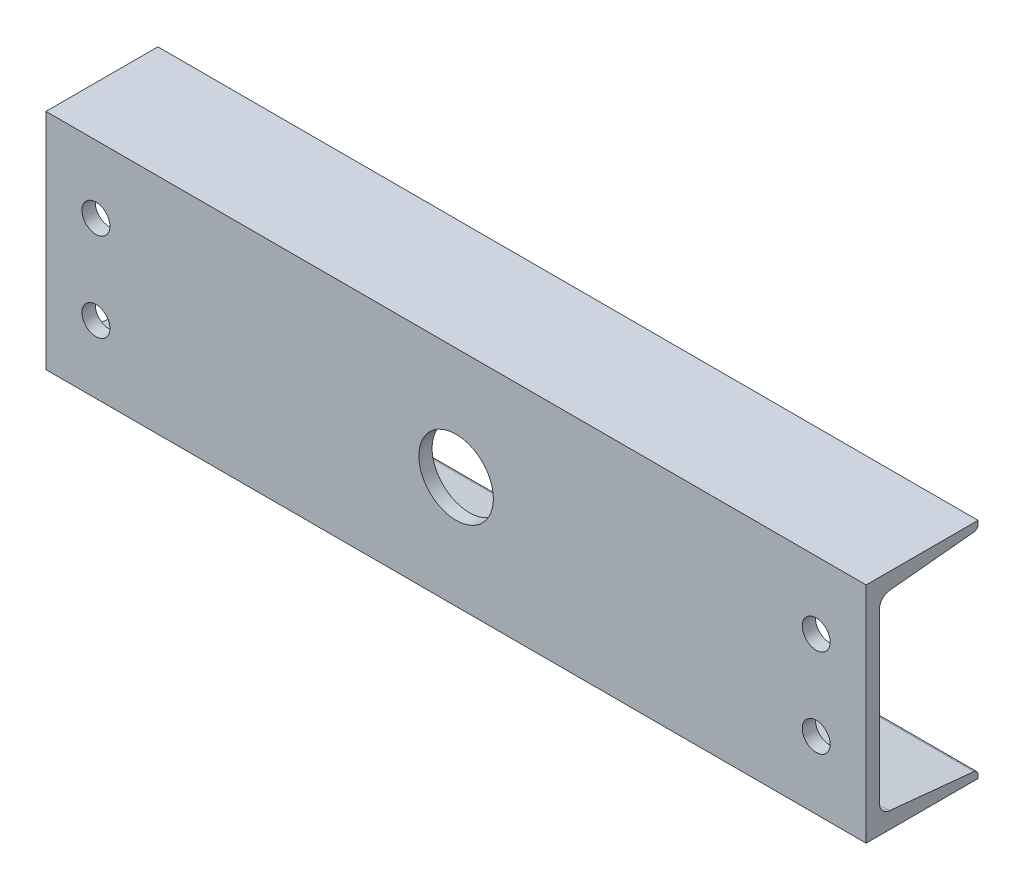
ISO-10303-21;
HEADER;
FILE_DESCRIPTION(('STEP AP214'),'2;1');
FILE_NAME('part.step','',(''),(''),'','','');
FILE_SCHEMA(('AUTOMOTIVE_DESIGN { 1 0 10303 214 1 1 1 1 }'));
ENDSEC;
DATA;
#1=APPLICATION_CONTEXT('core data for automotive mechanical design processes');
#2=APPLICATION_PROTOCOL_DEFINITION('international standard','automotive_design',2000,#1);
#3=PRODUCT_CONTEXT('',#1,'mechanical');
#4=PRODUCT('Part','Part','',(#3));
#5=PRODUCT_RELATED_PRODUCT_CATEGORY('part','',(#4));
#6=PRODUCT_DEFINITION_FORMATION('','',#4);
#7=PRODUCT_DEFINITION_CONTEXT('part definition',#1,'design');
#8=PRODUCT_DEFINITION('design','',#6,#7);
#9=PRODUCT_DEFINITION_SHAPE('','',#8);
#10=(LENGTH_UNIT() NAMED_UNIT(*) SI_UNIT(.MILLI.,.METRE.));
#11=(NAMED_UNIT(*) PLANE_ANGLE_UNIT() SI_UNIT($,.RADIAN.));
#12=(NAMED_UNIT(*) SI_UNIT($,.STERADIAN.) SOLID_ANGLE_UNIT());
#13=UNCERTAINTY_MEASURE_WITH_UNIT(LENGTH_MEASURE(1.E-05),#10,'distance_accuracy_value','');
#14=(GEOMETRIC_REPRESENTATION_CONTEXT(3) GLOBAL_UNCERTAINTY_ASSIGNED_CONTEXT((#13)) GLOBAL_UNIT_ASSIGNED_CONTEXT((#10,
#11,#12)) REPRESENTATION_CONTEXT('',''));
#15=CARTESIAN_POINT('',(0.,0.,0.));
#16=DIRECTION('',(0.,0.,1.));
#17=DIRECTION('',(1.,0.,0.));
#18=AXIS2_PLACEMENT_3D('',#15,#16,#17);
#19=CARTESIAN_POINT('',(279.4,-76.2,48.8061));
#20=DIRECTION('',(0.,1.,0.));
#21=DIRECTION('',(0.,0.,1.));
#22=AXIS2_PLACEMENT_3D('',#19,#20,#21);
#23=PLANE('',#22);
#24=DIRECTION('',(0.,0.,-1.));
#25=VECTOR('',#24,1.);
#26=CARTESIAN_POINT('',(-279.4,-76.2,48.8061));
#27=LINE('',#26,#25);
#28=CARTESIAN_POINT('',(-279.4,-76.2,48.8061));
#29=VERTEX_POINT('',#28);
#30=CARTESIAN_POINT('',(-279.4,-76.2,-27.3939));
#31=VERTEX_POINT('',#30);
#32=EDGE_CURVE('E157',#29,#31,#27,.T.);
#33=ORIENTED_EDGE('',*,*,#32,.T.);
#34=DIRECTION('',(-1.,0.,0.));
#35=VECTOR('',#34,1.);
#36=CARTESIAN_POINT('',(279.4,-76.2,-27.3939));
#37=LINE('',#36,#35);
#38=CARTESIAN_POINT('',(279.4,-76.2,-27.3939));
#39=VERTEX_POINT('',#38);
#40=EDGE_CURVE('E11',#39,#31,#37,.T.);
#41=ORIENTED_EDGE('',*,*,#40,.F.);
#42=DIRECTION('',(0.,0.,-1.));
#43=VECTOR('',#42,1.);
#44=CARTESIAN_POINT('',(279.4,-76.2,48.8061));
#45=LINE('',#44,#43);
#46=CARTESIAN_POINT('',(279.4,-76.2,48.8061));
#47=VERTEX_POINT('',#46);
#48=EDGE_CURVE('E180',#47,#39,#45,.T.);
#49=ORIENTED_EDGE('',*,*,#48,.F.);
#50=DIRECTION('',(-1.,0.,0.));
#51=VECTOR('',#50,1.);
#52=CARTESIAN_POINT('',(279.4,-76.2,48.8061));
#53=LINE('',#52,#51);
#54=EDGE_CURVE('E153',#47,#29,#53,.T.);
#55=ORIENTED_EDGE('',*,*,#54,.T.);
#56=EDGE_LOOP('',(#33,#41,#49,#55));
#57=FACE_BOUND('',#56,.T.);
#58=ADVANCED_FACE('F37',(#57),#23,.F.);
#59=CARTESIAN_POINT('',(279.4,-76.2,-27.3939));
#60=DIRECTION('',(0.,0.,1.));
#61=DIRECTION('',(1.,0.,0.));
#62=AXIS2_PLACEMENT_3D('',#59,#60,#61);
#63=PLANE('',#62);
#64=DIRECTION('',(0.,1.,0.));
#65=VECTOR('',#64,1.);
#66=CARTESIAN_POINT('',(-279.4,-76.2,-27.3939));
#67=LINE('',#66,#65);
#68=CARTESIAN_POINT('',(-279.4,-73.7107446530364,-27.3939));
#69=VERTEX_POINT('',#68);
#70=EDGE_CURVE('E160',#31,#69,#67,.T.);
#71=ORIENTED_EDGE('',*,*,#70,.T.);
#72=DIRECTION('',(-1.,0.,0.));
#73=VECTOR('',#72,1.);
#74=CARTESIAN_POINT('',(279.4,-73.7107446530364,-27.3939));
#75=LINE('',#74,#73);
#76=CARTESIAN_POINT('',(279.4,-73.7107446530364,-27.3939));
#77=VERTEX_POINT('',#76);
#78=EDGE_CURVE('E45',#77,#69,#75,.T.);
#79=ORIENTED_EDGE('',*,*,#78,.F.);
#80=DIRECTION('',(0.,1.,0.));
#81=VECTOR('',#80,1.);
#82=CARTESIAN_POINT('',(279.4,-76.2,-27.3939));
#83=LINE('',#82,#81);
#84=EDGE_CURVE('E108',#39,#77,#83,.T.);
#85=ORIENTED_EDGE('',*,*,#84,.F.);
#86=ORIENTED_EDGE('',*,*,#40,.T.);
#87=EDGE_LOOP('',(#71,#79,#85,#86));
#88=FACE_BOUND('',#87,.T.);
#89=ADVANCED_FACE('F261',(#88),#63,.F.);
#90=CARTESIAN_POINT('',(279.4,-73.7107446530364,-24.3459));
#91=DIRECTION('',(-1.,0.,0.));
#92=DIRECTION('',(0.,0.,1.));
#93=AXIS2_PLACEMENT_3D('',#90,#91,#92);
#94=CYLINDRICAL_SURFACE('',#93,3.048);
#95=CARTESIAN_POINT('',(-279.4,-73.7107446530364,-24.3459));
#96=DIRECTION('',(1.,0.,0.));
#97=DIRECTION('',(0.,0.,-1.));
#98=AXIS2_PLACEMENT_3D('',#95,#96,#97);
#99=CIRCLE('',#98,3.048);
#100=CARTESIAN_POINT('',(-279.4,-70.6776049754313,-24.6465122022433));
#101=VERTEX_POINT('',#100);
#102=EDGE_CURVE('E163',#69,#101,#99,.T.);
#103=ORIENTED_EDGE('',*,*,#102,.T.);
#104=DIRECTION('',(-1.,0.,0.));
#105=VECTOR('',#104,1.);
#106=CARTESIAN_POINT('',(279.4,-70.6776049754313,-24.6465122022433));
#107=LINE('',#106,#105);
#108=CARTESIAN_POINT('',(279.4,-70.6776049754313,-24.6465122022433));
#109=VERTEX_POINT('',#108);
#110=EDGE_CURVE('E199',#109,#101,#107,.T.);
#111=ORIENTED_EDGE('',*,*,#110,.F.);
#112=CARTESIAN_POINT('',(279.4,-73.7107446530364,-24.3459));
#113=DIRECTION('',(1.,0.,0.));
#114=DIRECTION('',(0.,0.,-1.));
#115=AXIS2_PLACEMENT_3D('',#112,#113,#114);
#116=CIRCLE('',#115,3.048);
#117=EDGE_CURVE('E207',#77,#109,#116,.T.);
#118=ORIENTED_EDGE('',*,*,#117,.F.);
#119=ORIENTED_EDGE('',*,*,#78,.T.);
#120=EDGE_LOOP('',(#103,#111,#118,#119));
#121=FACE_BOUND('',#120,.T.);
#122=ADVANCED_FACE('F205',(#121),#94,.T.);
#123=CARTESIAN_POINT('',(279.4,-64.9746859427069,32.8952305056083));
#124=DIRECTION('',(0.,-0.995124566143408,0.0986260506047631));
#125=DIRECTION('',(0.,-0.0986260506047631,-0.995124566143408));
#126=AXIS2_PLACEMENT_3D('',#123,#124,#125);
#127=PLANE('',#126);
#128=DIRECTION('',(0.,0.0986260506047631,0.995124566143408));
#129=VECTOR('',#128,1.);
#130=CARTESIAN_POINT('',(-279.4,-64.9746859427069,32.8952305056083));
#131=LINE('',#130,#129);
#132=CARTESIAN_POINT('',(-279.4,-64.9746859427069,32.8952305056083));
#133=VERTEX_POINT('',#132);
#134=EDGE_CURVE('E165',#101,#133,#131,.T.);
#135=ORIENTED_EDGE('',*,*,#134,.T.);
#136=DIRECTION('',(-1.,0.,0.));
#137=VECTOR('',#136,1.);
#138=CARTESIAN_POINT('',(279.4,-64.9746859427069,32.8952305056083));
#139=LINE('',#138,#137);
#140=CARTESIAN_POINT('',(279.4,-64.9746859427069,32.8952305056083));
#141=VERTEX_POINT('',#140);
#142=EDGE_CURVE('E196',#141,#133,#139,.T.);
#143=ORIENTED_EDGE('',*,*,#142,.F.);
#144=DIRECTION('',(0.,0.0986260506047631,0.995124566143408));
#145=VECTOR('',#144,1.);
#146=CARTESIAN_POINT('',(279.4,-64.9746859427069,32.8952305056083));
#147=LINE('',#146,#145);
#148=EDGE_CURVE('E225',#109,#141,#147,.T.);
#149=ORIENTED_EDGE('',*,*,#148,.F.);
#150=ORIENTED_EDGE('',*,*,#110,.T.);
#151=EDGE_LOOP('',(#135,#143,#149,#150));
#152=FACE_BOUND('',#151,.T.);
#153=ADVANCED_FACE('F216',(#152),#127,.F.);
#154=CARTESIAN_POINT('',(279.4,-57.3918367486941,32.1437));
#155=DIRECTION('',(-1.,0.,0.));
#156=DIRECTION('',(0.,0.,1.));
#157=AXIS2_PLACEMENT_3D('',#154,#155,#156);
#158=CYLINDRICAL_SURFACE('',#157,7.62000000000001);
#159=CARTESIAN_POINT('',(-279.4,-57.3918367486941,32.1437));
#160=DIRECTION('',(-1.,0.,0.));
#161=DIRECTION('',(0.,0.,-1.));
#162=AXIS2_PLACEMENT_3D('',#159,#160,#161);
#163=CIRCLE('',#162,7.62000000000001);
#164=CARTESIAN_POINT('',(-279.4,-57.3918367486941,39.7637));
#165=VERTEX_POINT('',#164);
#166=EDGE_CURVE('E167',#133,#165,#163,.T.);
#167=ORIENTED_EDGE('',*,*,#166,.T.);
#168=DIRECTION('',(-1.,0.,0.));
#169=VECTOR('',#168,1.);
#170=CARTESIAN_POINT('',(279.4,-57.3918367486941,39.7637));
#171=LINE('',#170,#169);
#172=CARTESIAN_POINT('',(279.4,-57.3918367486941,39.7637));
#173=VERTEX_POINT('',#172);
#174=EDGE_CURVE('E193',#173,#165,#171,.T.);
#175=ORIENTED_EDGE('',*,*,#174,.F.);
#176=CARTESIAN_POINT('',(279.4,-57.3918367486941,32.1437));
#177=DIRECTION('',(-1.,0.,0.));
#178=DIRECTION('',(0.,0.,-1.));
#179=AXIS2_PLACEMENT_3D('',#176,#177,#178);
#180=CIRCLE('',#179,7.62000000000001);
#181=EDGE_CURVE('E222',#141,#173,#180,.T.);
#182=ORIENTED_EDGE('',*,*,#181,.F.);
#183=ORIENTED_EDGE('',*,*,#142,.T.);
#184=EDGE_LOOP('',(#167,#175,#182,#183));
#185=FACE_BOUND('',#184,.T.);
#186=ADVANCED_FACE('F220',(#185),#158,.F.);
#187=CARTESIAN_POINT('',(279.4,57.3918367486941,39.7637));
#188=DIRECTION('',(0.,0.,1.));
#189=DIRECTION('',(0.,-1.,0.));
#190=AXIS2_PLACEMENT_3D('',#187,#188,#189);
#191=PLANE('',#190);
#192=CARTESIAN_POINT('',(-245.364,-30.1625000000001,39.7637));
#193=DIRECTION('',(0.,0.,1.));
#194=DIRECTION('',(0.,-1.,0.));
#195=AXIS2_PLACEMENT_3D('',#192,#193,#194);
#196=CIRCLE('',#195,9.525);
#197=CARTESIAN_POINT('',(-245.364,-39.6875000000001,39.7637));
#198=VERTEX_POINT('',#197);
#199=EDGE_CURVE('E379',#198,#198,#196,.F.);
#200=ORIENTED_EDGE('',*,*,#199,.F.);
#201=EDGE_LOOP('',(#200));
#202=FACE_BOUND('',#201,.T.);
#203=CARTESIAN_POINT('',(245.364,-30.1625000000001,39.7637));
#204=DIRECTION('',(0.,0.,1.));
#205=DIRECTION('',(0.,-1.,0.));
#206=AXIS2_PLACEMENT_3D('',#203,#204,#205);
#207=CIRCLE('',#206,9.52500000000002);
#208=CARTESIAN_POINT('',(245.364,-39.6875000000001,39.7637));
#209=VERTEX_POINT('',#208);
#210=EDGE_CURVE('E383',#209,#209,#207,.F.);
#211=ORIENTED_EDGE('',*,*,#210,.F.);
#212=EDGE_LOOP('',(#211));
#213=FACE_BOUND('',#212,.T.);
#214=CARTESIAN_POINT('',(245.364,30.1625000000001,39.7637));
#215=DIRECTION('',(0.,0.,1.));
#216=DIRECTION('',(0.,-1.,0.));
#217=AXIS2_PLACEMENT_3D('',#214,#215,#216);
#218=CIRCLE('',#217,9.52500000000002);
#219=CARTESIAN_POINT('',(245.364,20.6375000000001,39.7637));
#220=VERTEX_POINT('',#219);
#221=EDGE_CURVE('E392',#220,#220,#218,.F.);
#222=ORIENTED_EDGE('',*,*,#221,.F.);
#223=EDGE_LOOP('',(#222));
#224=FACE_BOUND('',#223,.T.);
#225=CARTESIAN_POINT('',(-245.364,30.1625,39.7637));
#226=DIRECTION('',(0.,0.,1.));
#227=DIRECTION('',(0.,-1.,0.));
#228=AXIS2_PLACEMENT_3D('',#225,#226,#227);
#229=CIRCLE('',#228,9.525);
#230=CARTESIAN_POINT('',(-245.364,20.6375,39.7637));
#231=VERTEX_POINT('',#230);
#232=EDGE_CURVE('E398',#231,#231,#229,.F.);
#233=ORIENTED_EDGE('',*,*,#232,.F.);
#234=EDGE_LOOP('',(#233));
#235=FACE_BOUND('',#234,.T.);
#236=CARTESIAN_POINT('',(0.,0.,39.7637));
#237=DIRECTION('',(0.,0.,1.));
#238=DIRECTION('',(0.,-1.,0.));
#239=AXIS2_PLACEMENT_3D('',#236,#237,#238);
#240=CIRCLE('',#239,25.4);
#241=CARTESIAN_POINT('',(0.,-25.4,39.7637));
#242=VERTEX_POINT('',#241);
#243=EDGE_CURVE('E161',#242,#242,#240,.F.);
#244=ORIENTED_EDGE('',*,*,#243,.F.);
#245=EDGE_LOOP('',(#244));
#246=FACE_BOUND('',#245,.T.);
#247=DIRECTION('',(0.,1.,0.));
#248=VECTOR('',#247,1.);
#249=CARTESIAN_POINT('',(-279.4,57.3918367486941,39.7637));
#250=LINE('',#249,#248);
#251=CARTESIAN_POINT('',(-279.4,57.3918367486941,39.7637));
#252=VERTEX_POINT('',#251);
#253=EDGE_CURVE('E169',#165,#252,#250,.T.);
#254=ORIENTED_EDGE('',*,*,#253,.T.);
#255=DIRECTION('',(-1.,0.,0.));
#256=VECTOR('',#255,1.);
#257=CARTESIAN_POINT('',(279.4,57.3918367486941,39.7637));
#258=LINE('',#257,#256);
#259=CARTESIAN_POINT('',(279.4,57.3918367486941,39.7637));
#260=VERTEX_POINT('',#259);
#261=EDGE_CURVE('E190',#260,#252,#258,.T.);
#262=ORIENTED_EDGE('',*,*,#261,.F.);
#263=DIRECTION('',(0.,1.,0.));
#264=VECTOR('',#263,1.);
#265=CARTESIAN_POINT('',(279.4,57.3918367486941,39.7637));
#266=LINE('',#265,#264);
#267=EDGE_CURVE('E224',#173,#260,#266,.T.);
#268=ORIENTED_EDGE('',*,*,#267,.F.);
#269=ORIENTED_EDGE('',*,*,#174,.T.);
#270=EDGE_LOOP('',(#254,#262,#268,#269));
#271=FACE_BOUND('',#270,.T.);
#272=ADVANCED_FACE('F274',(#202,#213,#224,#235,#246,#271),#191,.F.);
#273=CARTESIAN_POINT('',(279.4,57.3918367486941,32.1437));
#274=DIRECTION('',(-1.,0.,0.));
#275=DIRECTION('',(0.,0.,1.));
#276=AXIS2_PLACEMENT_3D('',#273,#274,#275);
#277=CYLINDRICAL_SURFACE('',#276,7.62);
#278=CARTESIAN_POINT('',(-279.4,57.3918367486941,32.1437));
#279=DIRECTION('',(-1.,0.,0.));
#280=DIRECTION('',(0.,0.,1.));
#281=AXIS2_PLACEMENT_3D('',#278,#279,#280);
#282=CIRCLE('',#281,7.62);
#283=CARTESIAN_POINT('',(-279.4,64.9746859427069,32.8952305056083));
#284=VERTEX_POINT('',#283);
#285=EDGE_CURVE('E171',#252,#284,#282,.T.);
#286=ORIENTED_EDGE('',*,*,#285,.T.);
#287=DIRECTION('',(-1.,0.,0.));
#288=VECTOR('',#287,1.);
#289=CARTESIAN_POINT('',(279.4,64.9746859427069,32.8952305056083));
#290=LINE('',#289,#288);
#291=CARTESIAN_POINT('',(279.4,64.9746859427069,32.8952305056083));
#292=VERTEX_POINT('',#291);
#293=EDGE_CURVE('E187',#292,#284,#290,.T.);
#294=ORIENTED_EDGE('',*,*,#293,.F.);
#295=CARTESIAN_POINT('',(279.4,57.3918367486941,32.1437));
#296=DIRECTION('',(-1.,0.,0.));
#297=DIRECTION('',(0.,0.,1.));
#298=AXIS2_PLACEMENT_3D('',#295,#296,#297);
#299=CIRCLE('',#298,7.62);
#300=EDGE_CURVE('E227',#260,#292,#299,.T.);
#301=ORIENTED_EDGE('',*,*,#300,.F.);
#302=ORIENTED_EDGE('',*,*,#261,.T.);
#303=EDGE_LOOP('',(#286,#294,#301,#302));
#304=FACE_BOUND('',#303,.T.);
#305=ADVANCED_FACE('F277',(#304),#277,.F.);
#306=CARTESIAN_POINT('',(279.4,64.9746859427069,32.8952305056083));
#307=DIRECTION('',(0.,0.995124566143408,0.0986260506047639));
#308=DIRECTION('',(0.,-0.0986260506047639,0.995124566143408));
#309=AXIS2_PLACEMENT_3D('',#306,#307,#308);
#310=PLANE('',#309);
#311=DIRECTION('',(0.,0.0986260506047639,-0.995124566143408));
#312=VECTOR('',#311,1.);
#313=CARTESIAN_POINT('',(-279.4,64.9746859427069,32.8952305056083));
#314=LINE('',#313,#312);
#315=CARTESIAN_POINT('',(-279.4,70.6776049754313,-24.6465122022433));
#316=VERTEX_POINT('',#315);
#317=EDGE_CURVE('E173',#284,#316,#314,.T.);
#318=ORIENTED_EDGE('',*,*,#317,.T.);
#319=DIRECTION('',(-1.,0.,0.));
#320=VECTOR('',#319,1.);
#321=CARTESIAN_POINT('',(279.4,70.6776049754313,-24.6465122022433));
#322=LINE('',#321,#320);
#323=CARTESIAN_POINT('',(279.4,70.6776049754313,-24.6465122022433));
#324=VERTEX_POINT('',#323);
#325=EDGE_CURVE('E184',#324,#316,#322,.T.);
#326=ORIENTED_EDGE('',*,*,#325,.F.);
#327=DIRECTION('',(0.,0.0986260506047639,-0.995124566143408));
#328=VECTOR('',#327,1.);
#329=CARTESIAN_POINT('',(279.4,64.9746859427069,32.8952305056083));
#330=LINE('',#329,#328);
#331=EDGE_CURVE('E233',#292,#324,#330,.T.);
#332=ORIENTED_EDGE('',*,*,#331,.F.);
#333=ORIENTED_EDGE('',*,*,#293,.T.);
#334=EDGE_LOOP('',(#318,#326,#332,#333));
#335=FACE_BOUND('',#334,.T.);
#336=ADVANCED_FACE('F239',(#335),#310,.F.);
#337=CARTESIAN_POINT('',(279.4,73.7107446530364,-24.3459));
#338=DIRECTION('',(-1.,0.,0.));
#339=DIRECTION('',(0.,0.,1.));
#340=AXIS2_PLACEMENT_3D('',#337,#338,#339);
#341=CYLINDRICAL_SURFACE('',#340,3.04799999999997);
#342=CARTESIAN_POINT('',(-279.4,73.7107446530364,-24.3459));
#343=DIRECTION('',(1.,0.,0.));
#344=DIRECTION('',(0.,0.,1.));
#345=AXIS2_PLACEMENT_3D('',#342,#343,#344);
#346=CIRCLE('',#345,3.04799999999997);
#347=CARTESIAN_POINT('',(-279.4,73.7107446530364,-27.3939));
#348=VERTEX_POINT('',#347);
#349=EDGE_CURVE('E175',#316,#348,#346,.T.);
#350=ORIENTED_EDGE('',*,*,#349,.T.);
#351=DIRECTION('',(-1.,0.,0.));
#352=VECTOR('',#351,1.);
#353=CARTESIAN_POINT('',(279.4,73.7107446530364,-27.3939));
#354=LINE('',#353,#352);
#355=CARTESIAN_POINT('',(279.4,73.7107446530364,-27.3939));
#356=VERTEX_POINT('',#355);
#357=EDGE_CURVE('E148',#356,#348,#354,.T.);
#358=ORIENTED_EDGE('',*,*,#357,.F.);
#359=CARTESIAN_POINT('',(279.4,73.7107446530364,-24.3459));
#360=DIRECTION('',(1.,0.,0.));
#361=DIRECTION('',(0.,0.,1.));
#362=AXIS2_PLACEMENT_3D('',#359,#360,#361);
#363=CIRCLE('',#362,3.04799999999997);
#364=EDGE_CURVE('E139',#324,#356,#363,.T.);
#365=ORIENTED_EDGE('',*,*,#364,.F.);
#366=ORIENTED_EDGE('',*,*,#325,.T.);
#367=EDGE_LOOP('',(#350,#358,#365,#366));
#368=FACE_BOUND('',#367,.T.);
#369=ADVANCED_FACE('F243',(#368),#341,.T.);
#370=CARTESIAN_POINT('',(279.4,76.2,-27.3939));
#371=DIRECTION('',(0.,0.,1.));
#372=DIRECTION('',(0.,-1.,0.));
#373=AXIS2_PLACEMENT_3D('',#370,#371,#372);
#374=PLANE('',#373);
#375=DIRECTION('',(0.,1.,0.));
#376=VECTOR('',#375,1.);
#377=CARTESIAN_POINT('',(-279.4,76.2,-27.3939));
#378=LINE('',#377,#376);
#379=CARTESIAN_POINT('',(-279.4,76.2,-27.3939));
#380=VERTEX_POINT('',#379);
#381=EDGE_CURVE('E147',#348,#380,#378,.T.);
#382=ORIENTED_EDGE('',*,*,#381,.T.);
#383=DIRECTION('',(-1.,0.,0.));
#384=VECTOR('',#383,1.);
#385=CARTESIAN_POINT('',(279.4,76.2,-27.3939));
#386=LINE('',#385,#384);
#387=CARTESIAN_POINT('',(279.4,76.2,-27.3939));
#388=VERTEX_POINT('',#387);
#389=EDGE_CURVE('E144',#388,#380,#386,.T.);
#390=ORIENTED_EDGE('',*,*,#389,.F.);
#391=DIRECTION('',(0.,1.,0.));
#392=VECTOR('',#391,1.);
#393=CARTESIAN_POINT('',(279.4,76.2,-27.3939));
#394=LINE('',#393,#392);
#395=EDGE_CURVE('E133',#356,#388,#394,.T.);
#396=ORIENTED_EDGE('',*,*,#395,.F.);
#397=ORIENTED_EDGE('',*,*,#357,.T.);
#398=EDGE_LOOP('',(#382,#390,#396,#397));
#399=FACE_BOUND('',#398,.T.);
#400=ADVANCED_FACE('F145',(#399),#374,.F.);
#401=CARTESIAN_POINT('',(279.4,76.2,48.8061));
#402=DIRECTION('',(0.,-1.,0.));
#403=DIRECTION('',(0.,0.,-1.));
#404=AXIS2_PLACEMENT_3D('',#401,#402,#403);
#405=PLANE('',#404);
#406=DIRECTION('',(0.,0.,1.));
#407=VECTOR('',#406,1.);
#408=CARTESIAN_POINT('',(-279.4,76.2,48.8061));
#409=LINE('',#408,#407);
#410=CARTESIAN_POINT('',(-279.4,76.2,48.8061));
#411=VERTEX_POINT('',#410);
#412=EDGE_CURVE('E94',#380,#411,#409,.T.);
#413=ORIENTED_EDGE('',*,*,#412,.T.);
#414=DIRECTION('',(-1.,0.,0.));
#415=VECTOR('',#414,1.);
#416=CARTESIAN_POINT('',(279.4,76.2,48.8061));
#417=LINE('',#416,#415);
#418=CARTESIAN_POINT('',(279.4,76.2,48.8061));
#419=VERTEX_POINT('',#418);
#420=EDGE_CURVE('E149',#419,#411,#417,.T.);
#421=ORIENTED_EDGE('',*,*,#420,.F.);
#422=DIRECTION('',(0.,0.,1.));
#423=VECTOR('',#422,1.);
#424=CARTESIAN_POINT('',(279.4,76.2,48.8061));
#425=LINE('',#424,#423);
#426=EDGE_CURVE('E137',#388,#419,#425,.T.);
#427=ORIENTED_EDGE('',*,*,#426,.F.);
#428=ORIENTED_EDGE('',*,*,#389,.T.);
#429=EDGE_LOOP('',(#413,#421,#427,#428));
#430=FACE_BOUND('',#429,.T.);
#431=ADVANCED_FACE('F151',(#430),#405,.F.);
#432=CARTESIAN_POINT('',(279.4,-76.2,48.8061));
#433=DIRECTION('',(0.,0.,-1.));
#434=DIRECTION('',(-1.,0.,0.));
#435=AXIS2_PLACEMENT_3D('',#432,#433,#434);
#436=PLANE('',#435);
#437=CARTESIAN_POINT('',(-245.364,-30.1625000000001,48.8061));
#438=DIRECTION('',(0.,0.,1.));
#439=DIRECTION('',(-1.,0.,0.));
#440=AXIS2_PLACEMENT_3D('',#437,#438,#439);
#441=CIRCLE('',#440,9.525);
#442=CARTESIAN_POINT('',(-254.889,-30.1625000000001,48.8061));
#443=VERTEX_POINT('',#442);
#444=EDGE_CURVE('E376',#443,#443,#441,.T.);
#445=ORIENTED_EDGE('',*,*,#444,.F.);
#446=EDGE_LOOP('',(#445));
#447=FACE_BOUND('',#446,.T.);
#448=CARTESIAN_POINT('',(245.364,-30.1625000000001,48.8061));
#449=DIRECTION('',(0.,0.,1.));
#450=DIRECTION('',(1.,0.,0.));
#451=AXIS2_PLACEMENT_3D('',#448,#449,#450);
#452=CIRCLE('',#451,9.52500000000002);
#453=CARTESIAN_POINT('',(254.889,-30.1625000000001,48.8061));
#454=VERTEX_POINT('',#453);
#455=EDGE_CURVE('E380',#454,#454,#452,.T.);
#456=ORIENTED_EDGE('',*,*,#455,.F.);
#457=EDGE_LOOP('',(#456));
#458=FACE_BOUND('',#457,.T.);
#459=CARTESIAN_POINT('',(245.364,30.1625000000001,48.8061));
#460=DIRECTION('',(0.,0.,1.));
#461=DIRECTION('',(-1.,0.,0.));
#462=AXIS2_PLACEMENT_3D('',#459,#460,#461);
#463=CIRCLE('',#462,9.52500000000002);
#464=CARTESIAN_POINT('',(235.839,30.1625000000001,48.8061));
#465=VERTEX_POINT('',#464);
#466=EDGE_CURVE('E389',#465,#465,#463,.T.);
#467=ORIENTED_EDGE('',*,*,#466,.F.);
#468=EDGE_LOOP('',(#467));
#469=FACE_BOUND('',#468,.T.);
#470=CARTESIAN_POINT('',(-245.364,30.1625,48.8061));
#471=DIRECTION('',(0.,0.,1.));
#472=DIRECTION('',(1.,0.,0.));
#473=AXIS2_PLACEMENT_3D('',#470,#471,#472);
#474=CIRCLE('',#473,9.525);
#475=CARTESIAN_POINT('',(-235.839,30.1625,48.8061));
#476=VERTEX_POINT('',#475);
#477=EDGE_CURVE('E395',#476,#476,#474,.T.);
#478=ORIENTED_EDGE('',*,*,#477,.F.);
#479=EDGE_LOOP('',(#478));
#480=FACE_BOUND('',#479,.T.);
#481=CARTESIAN_POINT('',(0.,0.,48.8061));
#482=DIRECTION('',(0.,0.,1.));
#483=DIRECTION('',(1.,0.,0.));
#484=AXIS2_PLACEMENT_3D('',#481,#482,#483);
#485=CIRCLE('',#484,25.4);
#486=CARTESIAN_POINT('',(25.4,0.,48.8061));
#487=VERTEX_POINT('',#486);
#488=EDGE_CURVE('E401',#487,#487,#485,.T.);
#489=ORIENTED_EDGE('',*,*,#488,.F.);
#490=EDGE_LOOP('',(#489));
#491=FACE_BOUND('',#490,.T.);
#492=DIRECTION('',(0.,-1.,0.));
#493=VECTOR('',#492,1.);
#494=CARTESIAN_POINT('',(-279.4,-76.2,48.8061));
#495=LINE('',#494,#493);
#496=EDGE_CURVE('E100',#411,#29,#495,.T.);
#497=ORIENTED_EDGE('',*,*,#496,.T.);
#498=ORIENTED_EDGE('',*,*,#54,.F.);
#499=DIRECTION('',(0.,-1.,0.));
#500=VECTOR('',#499,1.);
#501=CARTESIAN_POINT('',(279.4,-76.2,48.8061));
#502=LINE('',#501,#500);
#503=EDGE_CURVE('E53',#419,#47,#502,.T.);
#504=ORIENTED_EDGE('',*,*,#503,.F.);
#505=ORIENTED_EDGE('',*,*,#420,.T.);
#506=EDGE_LOOP('',(#497,#498,#504,#505));
#507=FACE_BOUND('',#506,.T.);
#508=ADVANCED_FACE('F247',(#447,#458,#469,#480,#491,#507),#436,.F.);
#509=CARTESIAN_POINT('',(279.4,-73.7107446530364,-24.3459));
#510=DIRECTION('',(1.,0.,0.));
#511=DIRECTION('',(0.,0.,-1.));
#512=AXIS2_PLACEMENT_3D('',#509,#510,#511);
#513=PLANE('',#512);
#514=ORIENTED_EDGE('',*,*,#48,.T.);
#515=ORIENTED_EDGE('',*,*,#84,.T.);
#516=ORIENTED_EDGE('',*,*,#117,.T.);
#517=ORIENTED_EDGE('',*,*,#148,.T.);
#518=ORIENTED_EDGE('',*,*,#181,.T.);
#519=ORIENTED_EDGE('',*,*,#267,.T.);
#520=ORIENTED_EDGE('',*,*,#300,.T.);
#521=ORIENTED_EDGE('',*,*,#331,.T.);
#522=ORIENTED_EDGE('',*,*,#364,.T.);
#523=ORIENTED_EDGE('',*,*,#395,.T.);
#524=ORIENTED_EDGE('',*,*,#426,.T.);
#525=ORIENTED_EDGE('',*,*,#503,.T.);
#526=EDGE_LOOP('',(#514,#515,#516,#517,#518,#519,#520,#521,#522,#523,#524,#525));
#527=FACE_BOUND('',#526,.T.);
#528=ADVANCED_FACE('F135',(#527),#513,.T.);
#529=CARTESIAN_POINT('',(-279.4,-73.7107446530364,-24.3459));
#530=DIRECTION('',(1.,0.,0.));
#531=DIRECTION('',(0.,0.,-1.));
#532=AXIS2_PLACEMENT_3D('',#529,#530,#531);
#533=PLANE('',#532);
#534=ORIENTED_EDGE('',*,*,#32,.F.);
#535=ORIENTED_EDGE('',*,*,#496,.F.);
#536=ORIENTED_EDGE('',*,*,#412,.F.);
#537=ORIENTED_EDGE('',*,*,#381,.F.);
#538=ORIENTED_EDGE('',*,*,#349,.F.);
#539=ORIENTED_EDGE('',*,*,#317,.F.);
#540=ORIENTED_EDGE('',*,*,#285,.F.);
#541=ORIENTED_EDGE('',*,*,#253,.F.);
#542=ORIENTED_EDGE('',*,*,#166,.F.);
#543=ORIENTED_EDGE('',*,*,#134,.F.);
#544=ORIENTED_EDGE('',*,*,#102,.F.);
#545=ORIENTED_EDGE('',*,*,#70,.F.);
#546=EDGE_LOOP('',(#534,#535,#536,#537,#538,#539,#540,#541,#542,#543,#544,#545));
#547=FACE_BOUND('',#546,.T.);
#548=ADVANCED_FACE('F211',(#547),#533,.F.);
#549=CARTESIAN_POINT('',(0.,0.,-27.3949));
#550=DIRECTION('',(0.,0.,1.));
#551=DIRECTION('',(1.,0.,0.));
#552=AXIS2_PLACEMENT_3D('',#549,#550,#551);
#553=CYLINDRICAL_SURFACE('',#552,25.4);
#554=ORIENTED_EDGE('',*,*,#488,.T.);
#555=EDGE_LOOP('',(#554));
#556=FACE_BOUND('',#555,.T.);
#557=ORIENTED_EDGE('',*,*,#243,.T.);
#558=EDGE_LOOP('',(#557));
#559=FACE_BOUND('',#558,.T.);
#560=ADVANCED_FACE('F311',(#556,#559),#553,.F.);
#561=CARTESIAN_POINT('',(-245.364,30.1625,-27.3949));
#562=DIRECTION('',(0.,0.,1.));
#563=DIRECTION('',(1.,0.,0.));
#564=AXIS2_PLACEMENT_3D('',#561,#562,#563);
#565=CYLINDRICAL_SURFACE('',#564,9.525);
#566=ORIENTED_EDGE('',*,*,#477,.T.);
#567=EDGE_LOOP('',(#566));
#568=FACE_BOUND('',#567,.T.);
#569=ORIENTED_EDGE('',*,*,#232,.T.);
#570=EDGE_LOOP('',(#569));
#571=FACE_BOUND('',#570,.T.);
#572=ADVANCED_FACE('F319',(#568,#571),#565,.F.);
#573=CARTESIAN_POINT('',(245.364,30.1625000000001,-27.3949));
#574=DIRECTION('',(0.,0.,1.));
#575=DIRECTION('',(1.,0.,0.));
#576=AXIS2_PLACEMENT_3D('',#573,#574,#575);
#577=CYLINDRICAL_SURFACE('',#576,9.52500000000002);
#578=ORIENTED_EDGE('',*,*,#466,.T.);
#579=EDGE_LOOP('',(#578));
#580=FACE_BOUND('',#579,.T.);
#581=ORIENTED_EDGE('',*,*,#221,.T.);
#582=EDGE_LOOP('',(#581));
#583=FACE_BOUND('',#582,.T.);
#584=ADVANCED_FACE('F340',(#580,#583),#577,.F.);
#585=CARTESIAN_POINT('',(245.364,-30.1625000000001,-27.3949));
#586=DIRECTION('',(0.,0.,1.));
#587=DIRECTION('',(1.,0.,0.));
#588=AXIS2_PLACEMENT_3D('',#585,#586,#587);
#589=CYLINDRICAL_SURFACE('',#588,9.52500000000002);
#590=ORIENTED_EDGE('',*,*,#455,.T.);
#591=EDGE_LOOP('',(#590));
#592=FACE_BOUND('',#591,.T.);
#593=ORIENTED_EDGE('',*,*,#210,.T.);
#594=EDGE_LOOP('',(#593));
#595=FACE_BOUND('',#594,.T.);
#596=ADVANCED_FACE('F350',(#592,#595),#589,.F.);
#597=CARTESIAN_POINT('',(-245.364,-30.1625000000001,-27.3949));
#598=DIRECTION('',(0.,0.,1.));
#599=DIRECTION('',(1.,0.,0.));
#600=AXIS2_PLACEMENT_3D('',#597,#598,#599);
#601=CYLINDRICAL_SURFACE('',#600,9.525);
#602=ORIENTED_EDGE('',*,*,#444,.T.);
#603=EDGE_LOOP('',(#602));
#604=FACE_BOUND('',#603,.T.);
#605=ORIENTED_EDGE('',*,*,#199,.T.);
#606=EDGE_LOOP('',(#605));
#607=FACE_BOUND('',#606,.T.);
#608=ADVANCED_FACE('F360',(#604,#607),#601,.F.);
#609=CLOSED_SHELL('',(#58,#89,#122,#153,#186,#272,#305,#336,#369,#400,#431,#508,#528,#548,#560,
#572,#584,#596,#608));
#610=MANIFOLD_SOLID_BREP('B2',#609);
#611=ADVANCED_BREP_SHAPE_REPRESENTATION('',(#18,#610),#14);
#612=SHAPE_DEFINITION_REPRESENTATION(#9,#611);
ENDSEC;
END-ISO-10303-21;
